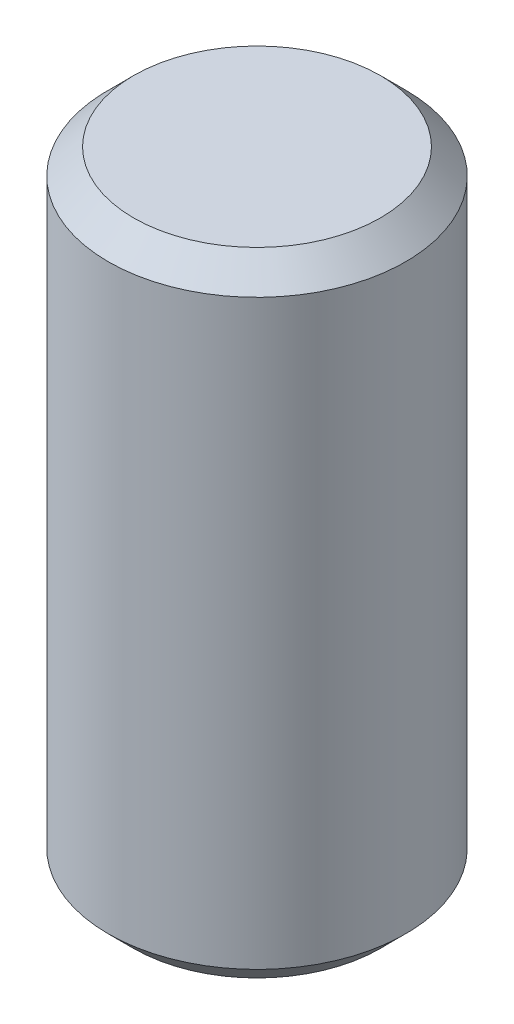
ISO-10303-21;
HEADER;
FILE_DESCRIPTION(('STEP AP214'),'2;1');
FILE_NAME('part.step','',(''),(''),'','','');
FILE_SCHEMA(('AUTOMOTIVE_DESIGN { 1 0 10303 214 1 1 1 1 }'));
ENDSEC;
DATA;
#1=APPLICATION_CONTEXT('core data for automotive mechanical design processes');
#2=APPLICATION_PROTOCOL_DEFINITION('international standard','automotive_design',2000,#1);
#3=PRODUCT_CONTEXT('',#1,'mechanical');
#4=PRODUCT('Part','Part','',(#3));
#5=PRODUCT_RELATED_PRODUCT_CATEGORY('part','',(#4));
#6=PRODUCT_DEFINITION_FORMATION('','',#4);
#7=PRODUCT_DEFINITION_CONTEXT('part definition',#1,'design');
#8=PRODUCT_DEFINITION('design','',#6,#7);
#9=PRODUCT_DEFINITION_SHAPE('','',#8);
#10=(LENGTH_UNIT() NAMED_UNIT(*) SI_UNIT(.MILLI.,.METRE.));
#11=(NAMED_UNIT(*) PLANE_ANGLE_UNIT() SI_UNIT($,.RADIAN.));
#12=(NAMED_UNIT(*) SI_UNIT($,.STERADIAN.) SOLID_ANGLE_UNIT());
#13=UNCERTAINTY_MEASURE_WITH_UNIT(LENGTH_MEASURE(1.E-05),#10,'distance_accuracy_value','');
#14=(GEOMETRIC_REPRESENTATION_CONTEXT(3) GLOBAL_UNCERTAINTY_ASSIGNED_CONTEXT((#13)) GLOBAL_UNIT_ASSIGNED_CONTEXT((#10,
#11,#12)) REPRESENTATION_CONTEXT('',''));
#15=CARTESIAN_POINT('',(0.,0.,0.));
#16=DIRECTION('',(0.,0.,1.));
#17=DIRECTION('',(1.,0.,0.));
#18=AXIS2_PLACEMENT_3D('',#15,#16,#17);
#19=CARTESIAN_POINT('',(0.,-6.35,0.));
#20=DIRECTION('',(0.,1.,0.));
#21=DIRECTION('',(0.,0.,1.));
#22=AXIS2_PLACEMENT_3D('',#19,#20,#21);
#23=PLANE('',#22);
#24=CARTESIAN_POINT('',(0.,-6.35,0.));
#25=DIRECTION('',(0.,1.,0.));
#26=DIRECTION('',(0.,0.,1.));
#27=AXIS2_PLACEMENT_3D('',#24,#25,#26);
#28=CIRCLE('',#27,2.4765);
#29=CARTESIAN_POINT('',(0.,-6.35,2.4765));
#30=VERTEX_POINT('',#29);
#31=EDGE_CURVE('E37',#30,#30,#28,.F.);
#32=ORIENTED_EDGE('',*,*,#31,.T.);
#33=EDGE_LOOP('',(#32));
#34=FACE_BOUND('',#33,.T.);
#35=ADVANCED_FACE('F30',(#34),#23,.F.);
#36=CARTESIAN_POINT('',(0.,6.08020788678209,0.));
#37=DIRECTION('',(0.,1.,0.));
#38=DIRECTION('',(0.,0.,1.));
#39=AXIS2_PLACEMENT_3D('',#36,#37,#38);
#40=CYLINDRICAL_SURFACE('',#39,2.9845);
#41=CARTESIAN_POINT('',(0.,-5.842,0.));
#42=DIRECTION('',(0.,1.,0.));
#43=DIRECTION('',(0.,0.,1.));
#44=AXIS2_PLACEMENT_3D('',#41,#42,#43);
#45=CIRCLE('',#44,2.9845);
#46=CARTESIAN_POINT('',(0.,-5.842,2.9845));
#47=VERTEX_POINT('',#46);
#48=EDGE_CURVE('E41',#47,#47,#45,.T.);
#49=ORIENTED_EDGE('',*,*,#48,.T.);
#50=EDGE_LOOP('',(#49));
#51=FACE_BOUND('',#50,.T.);
#52=CARTESIAN_POINT('',(0.,5.842,0.));
#53=DIRECTION('',(0.,-1.,0.));
#54=DIRECTION('',(0.,0.,-1.));
#55=AXIS2_PLACEMENT_3D('',#52,#53,#54);
#56=CIRCLE('',#55,2.9845);
#57=CARTESIAN_POINT('',(0.,5.842,-2.9845));
#58=VERTEX_POINT('',#57);
#59=EDGE_CURVE('E45',#58,#58,#56,.T.);
#60=ORIENTED_EDGE('',*,*,#59,.T.);
#61=EDGE_LOOP('',(#60));
#62=FACE_BOUND('',#61,.T.);
#63=ADVANCED_FACE('F51',(#51,#62),#40,.T.);
#64=CARTESIAN_POINT('',(2.9845,6.35,0.));
#65=DIRECTION('',(0.,-1.,0.));
#66=DIRECTION('',(0.,0.,-1.));
#67=AXIS2_PLACEMENT_3D('',#64,#65,#66);
#68=PLANE('',#67);
#69=CARTESIAN_POINT('',(0.,6.35,0.));
#70=DIRECTION('',(0.,-1.,0.));
#71=DIRECTION('',(0.,0.,-1.));
#72=AXIS2_PLACEMENT_3D('',#69,#70,#71);
#73=CIRCLE('',#72,2.4765);
#74=CARTESIAN_POINT('',(0.,6.35,-2.4765));
#75=VERTEX_POINT('',#74);
#76=EDGE_CURVE('E10',#75,#75,#73,.F.);
#77=ORIENTED_EDGE('',*,*,#76,.T.);
#78=EDGE_LOOP('',(#77));
#79=FACE_BOUND('',#78,.T.);
#80=ADVANCED_FACE('F59',(#79),#68,.F.);
#81=CARTESIAN_POINT('',(0.,-5.842,0.));
#82=DIRECTION('',(0.,1.,0.));
#83=DIRECTION('',(0.,0.,1.));
#84=AXIS2_PLACEMENT_3D('',#81,#82,#83);
#85=CONICAL_SURFACE('',#84,2.9845,0.78539816339745);
#86=ORIENTED_EDGE('',*,*,#31,.F.);
#87=EDGE_LOOP('',(#86));
#88=FACE_BOUND('',#87,.T.);
#89=ORIENTED_EDGE('',*,*,#48,.F.);
#90=EDGE_LOOP('',(#89));
#91=FACE_BOUND('',#90,.T.);
#92=ADVANCED_FACE('F55',(#88,#91),#85,.T.);
#93=CARTESIAN_POINT('',(0.,6.35,0.));
#94=DIRECTION('',(0.,-1.,0.));
#95=DIRECTION('',(0.,0.,-1.));
#96=AXIS2_PLACEMENT_3D('',#93,#94,#95);
#97=CONICAL_SURFACE('',#96,2.4765,0.785398163397447);
#98=ORIENTED_EDGE('',*,*,#59,.F.);
#99=EDGE_LOOP('',(#98));
#100=FACE_BOUND('',#99,.T.);
#101=ORIENTED_EDGE('',*,*,#76,.F.);
#102=EDGE_LOOP('',(#101));
#103=FACE_BOUND('',#102,.T.);
#104=ADVANCED_FACE('F32',(#100,#103),#97,.T.);
#105=CLOSED_SHELL('',(#35,#63,#80,#92,#104));
#106=MANIFOLD_SOLID_BREP('B2',#105);
#107=ADVANCED_BREP_SHAPE_REPRESENTATION('',(#18,#106),#14);
#108=SHAPE_DEFINITION_REPRESENTATION(#9,#107);
ENDSEC;
END-ISO-10303-21;
